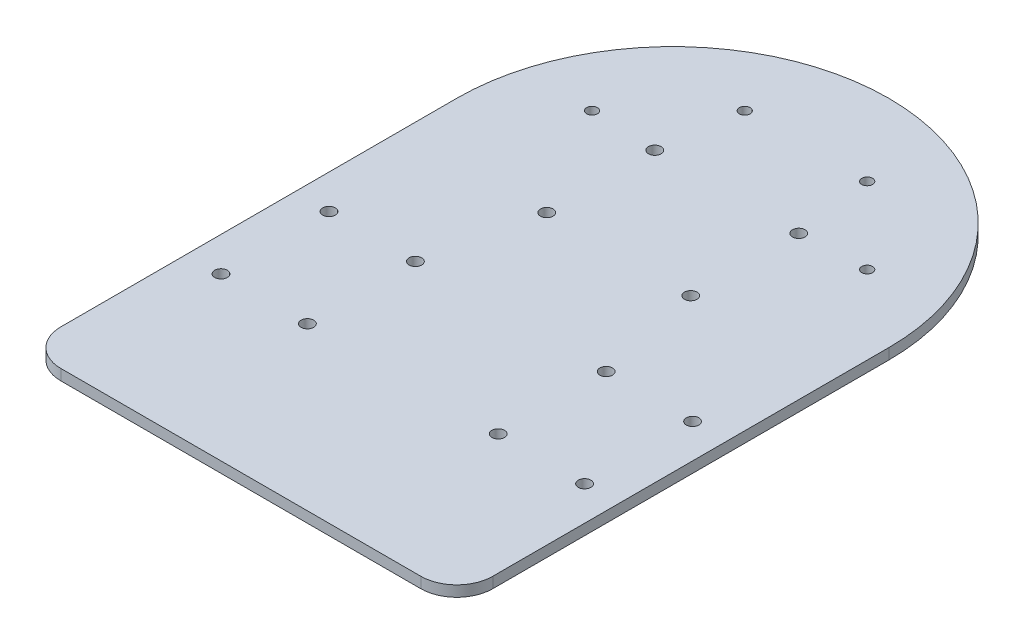
ISO-10303-21;
HEADER;
FILE_DESCRIPTION(('STEP AP214'),'2;1');
FILE_NAME('part.step','',(''),(''),'','','');
FILE_SCHEMA(('AUTOMOTIVE_DESIGN { 1 0 10303 214 1 1 1 1 }'));
ENDSEC;
DATA;
#1=APPLICATION_CONTEXT('core data for automotive mechanical design processes');
#2=APPLICATION_PROTOCOL_DEFINITION('international standard','automotive_design',2000,#1);
#3=PRODUCT_CONTEXT('',#1,'mechanical');
#4=PRODUCT('Part','Part','',(#3));
#5=PRODUCT_RELATED_PRODUCT_CATEGORY('part','',(#4));
#6=PRODUCT_DEFINITION_FORMATION('','',#4);
#7=PRODUCT_DEFINITION_CONTEXT('part definition',#1,'design');
#8=PRODUCT_DEFINITION('design','',#6,#7);
#9=PRODUCT_DEFINITION_SHAPE('','',#8);
#10=(LENGTH_UNIT() NAMED_UNIT(*) SI_UNIT(.MILLI.,.METRE.));
#11=(NAMED_UNIT(*) PLANE_ANGLE_UNIT() SI_UNIT($,.RADIAN.));
#12=(NAMED_UNIT(*) SI_UNIT($,.STERADIAN.) SOLID_ANGLE_UNIT());
#13=UNCERTAINTY_MEASURE_WITH_UNIT(LENGTH_MEASURE(1.E-05),#10,'distance_accuracy_value','');
#14=(GEOMETRIC_REPRESENTATION_CONTEXT(3) GLOBAL_UNCERTAINTY_ASSIGNED_CONTEXT((#13)) GLOBAL_UNIT_ASSIGNED_CONTEXT((#10,
#11,#12)) REPRESENTATION_CONTEXT('',''));
#15=CARTESIAN_POINT('',(0.,0.,0.));
#16=DIRECTION('',(0.,0.,1.));
#17=DIRECTION('',(1.,0.,0.));
#18=AXIS2_PLACEMENT_3D('',#15,#16,#17);
#19=CARTESIAN_POINT('',(0.,3.,-60.));
#20=DIRECTION('',(0.,-1.,0.));
#21=DIRECTION('',(0.,0.,-1.));
#22=AXIS2_PLACEMENT_3D('',#19,#20,#21);
#23=CYLINDRICAL_SURFACE('',#22,60.);
#24=CARTESIAN_POINT('',(0.,0.,-60.));
#25=DIRECTION('',(0.,1.,0.));
#26=DIRECTION('',(0.,0.,1.));
#27=AXIS2_PLACEMENT_3D('',#24,#25,#26);
#28=CIRCLE('',#27,60.);
#29=CARTESIAN_POINT('',(60.,0.,-60.));
#30=VERTEX_POINT('',#29);
#31=CARTESIAN_POINT('',(-60.,0.,-60.));
#32=VERTEX_POINT('',#31);
#33=EDGE_CURVE('E116',#30,#32,#28,.T.);
#34=ORIENTED_EDGE('',*,*,#33,.T.);
#35=DIRECTION('',(0.,-1.,0.));
#36=VECTOR('',#35,1.);
#37=CARTESIAN_POINT('',(-60.,3.,-60.));
#38=LINE('',#37,#36);
#39=CARTESIAN_POINT('',(-60.,3.,-60.));
#40=VERTEX_POINT('',#39);
#41=EDGE_CURVE('E97',#40,#32,#38,.T.);
#42=ORIENTED_EDGE('',*,*,#41,.F.);
#43=CARTESIAN_POINT('',(0.,3.,-60.));
#44=DIRECTION('',(0.,1.,0.));
#45=DIRECTION('',(0.,0.,1.));
#46=AXIS2_PLACEMENT_3D('',#43,#44,#45);
#47=CIRCLE('',#46,60.);
#48=CARTESIAN_POINT('',(60.,3.,-60.));
#49=VERTEX_POINT('',#48);
#50=EDGE_CURVE('E103',#49,#40,#47,.T.);
#51=ORIENTED_EDGE('',*,*,#50,.F.);
#52=DIRECTION('',(0.,-1.,0.));
#53=VECTOR('',#52,1.);
#54=CARTESIAN_POINT('',(60.,3.,-60.));
#55=LINE('',#54,#53);
#56=EDGE_CURVE('E119',#49,#30,#55,.T.);
#57=ORIENTED_EDGE('',*,*,#56,.T.);
#58=EDGE_LOOP('',(#34,#42,#51,#57));
#59=FACE_BOUND('',#58,.T.);
#60=ADVANCED_FACE('F40',(#59),#23,.T.);
#61=CARTESIAN_POINT('',(-60.,3.,-60.));
#62=DIRECTION('',(1.,0.,0.));
#63=DIRECTION('',(0.,0.,-1.));
#64=AXIS2_PLACEMENT_3D('',#61,#62,#63);
#65=PLANE('',#64);
#66=DIRECTION('',(0.,0.,1.));
#67=VECTOR('',#66,1.);
#68=CARTESIAN_POINT('',(-60.,0.,-60.));
#69=LINE('',#68,#67);
#70=CARTESIAN_POINT('',(-60.,0.,50.));
#71=VERTEX_POINT('',#70);
#72=EDGE_CURVE('E159',#32,#71,#69,.T.);
#73=ORIENTED_EDGE('',*,*,#72,.T.);
#74=DIRECTION('',(0.,-1.,0.));
#75=VECTOR('',#74,1.);
#76=CARTESIAN_POINT('',(-60.,3.,50.));
#77=LINE('',#76,#75);
#78=CARTESIAN_POINT('',(-60.,3.,50.));
#79=VERTEX_POINT('',#78);
#80=EDGE_CURVE('E11',#71,#79,#77,.F.);
#81=ORIENTED_EDGE('',*,*,#80,.T.);
#82=DIRECTION('',(0.,0.,1.));
#83=VECTOR('',#82,1.);
#84=CARTESIAN_POINT('',(-60.,3.,-60.));
#85=LINE('',#84,#83);
#86=EDGE_CURVE('E93',#40,#79,#85,.T.);
#87=ORIENTED_EDGE('',*,*,#86,.F.);
#88=ORIENTED_EDGE('',*,*,#41,.T.);
#89=EDGE_LOOP('',(#73,#81,#87,#88));
#90=FACE_BOUND('',#89,.T.);
#91=ADVANCED_FACE('F95',(#90),#65,.F.);
#92=CARTESIAN_POINT('',(-60.,3.,60.));
#93=DIRECTION('',(0.,0.,-1.));
#94=DIRECTION('',(-1.,0.,0.));
#95=AXIS2_PLACEMENT_3D('',#92,#93,#94);
#96=PLANE('',#95);
#97=DIRECTION('',(1.,0.,0.));
#98=VECTOR('',#97,1.);
#99=CARTESIAN_POINT('',(-60.,0.,60.));
#100=LINE('',#99,#98);
#101=CARTESIAN_POINT('',(-50.,0.,60.));
#102=VERTEX_POINT('',#101);
#103=CARTESIAN_POINT('',(50.,0.,60.));
#104=VERTEX_POINT('',#103);
#105=EDGE_CURVE('E155',#102,#104,#100,.T.);
#106=ORIENTED_EDGE('',*,*,#105,.T.);
#107=DIRECTION('',(0.,-1.,0.));
#108=VECTOR('',#107,1.);
#109=CARTESIAN_POINT('',(50.,3.,60.));
#110=LINE('',#109,#108);
#111=CARTESIAN_POINT('',(50.,3.,60.));
#112=VERTEX_POINT('',#111);
#113=EDGE_CURVE('E62',#104,#112,#110,.F.);
#114=ORIENTED_EDGE('',*,*,#113,.T.);
#115=DIRECTION('',(1.,0.,0.));
#116=VECTOR('',#115,1.);
#117=CARTESIAN_POINT('',(-60.,3.,60.));
#118=LINE('',#117,#116);
#119=CARTESIAN_POINT('',(-50.,3.,60.));
#120=VERTEX_POINT('',#119);
#121=EDGE_CURVE('E102',#120,#112,#118,.T.);
#122=ORIENTED_EDGE('',*,*,#121,.F.);
#123=DIRECTION('',(0.,-1.,0.));
#124=VECTOR('',#123,1.);
#125=CARTESIAN_POINT('',(-50.,3.,60.));
#126=LINE('',#125,#124);
#127=EDGE_CURVE('E134',#120,#102,#126,.T.);
#128=ORIENTED_EDGE('',*,*,#127,.T.);
#129=EDGE_LOOP('',(#106,#114,#122,#128));
#130=FACE_BOUND('',#129,.T.);
#131=ADVANCED_FACE('F156',(#130),#96,.F.);
#132=CARTESIAN_POINT('',(60.,3.,-60.));
#133=DIRECTION('',(-1.,0.,0.));
#134=DIRECTION('',(0.,0.,1.));
#135=AXIS2_PLACEMENT_3D('',#132,#133,#134);
#136=PLANE('',#135);
#137=DIRECTION('',(0.,0.,-1.));
#138=VECTOR('',#137,1.);
#139=CARTESIAN_POINT('',(60.,3.,-60.));
#140=LINE('',#139,#138);
#141=CARTESIAN_POINT('',(60.,3.,50.));
#142=VERTEX_POINT('',#141);
#143=EDGE_CURVE('E108',#142,#49,#140,.T.);
#144=ORIENTED_EDGE('',*,*,#143,.F.);
#145=DIRECTION('',(0.,-1.,0.));
#146=VECTOR('',#145,1.);
#147=CARTESIAN_POINT('',(60.,3.,50.));
#148=LINE('',#147,#146);
#149=CARTESIAN_POINT('',(60.,0.,50.));
#150=VERTEX_POINT('',#149);
#151=EDGE_CURVE('E118',#142,#150,#148,.T.);
#152=ORIENTED_EDGE('',*,*,#151,.T.);
#153=DIRECTION('',(0.,0.,-1.));
#154=VECTOR('',#153,1.);
#155=CARTESIAN_POINT('',(60.,0.,-60.));
#156=LINE('',#155,#154);
#157=EDGE_CURVE('E113',#150,#30,#156,.T.);
#158=ORIENTED_EDGE('',*,*,#157,.T.);
#159=ORIENTED_EDGE('',*,*,#56,.F.);
#160=EDGE_LOOP('',(#144,#152,#158,#159));
#161=FACE_BOUND('',#160,.T.);
#162=ADVANCED_FACE('F147',(#161),#136,.F.);
#163=CARTESIAN_POINT('',(0.,3.,-60.));
#164=DIRECTION('',(0.,1.,0.));
#165=DIRECTION('',(0.,0.,1.));
#166=AXIS2_PLACEMENT_3D('',#163,#164,#165);
#167=PLANE('',#166);
#168=CARTESIAN_POINT('',(38.2132034355964,3.,-75.7867965644035));
#169=DIRECTION('',(0.,1.,0.));
#170=DIRECTION('',(0.,0.,-1.));
#171=AXIS2_PLACEMENT_3D('',#168,#169,#170);
#172=CIRCLE('',#171,1.50000000000002);
#173=CARTESIAN_POINT('',(38.2132034355964,3.,-77.2867965644036));
#174=VERTEX_POINT('',#173);
#175=EDGE_CURVE('E279',#174,#174,#172,.T.);
#176=ORIENTED_EDGE('',*,*,#175,.F.);
#177=EDGE_LOOP('',(#176));
#178=FACE_BOUND('',#177,.T.);
#179=CARTESIAN_POINT('',(-17.,3.,-97.));
#180=DIRECTION('',(0.,1.,0.));
#181=DIRECTION('',(0.,0.,1.));
#182=AXIS2_PLACEMENT_3D('',#179,#180,#181);
#183=CIRCLE('',#182,1.5);
#184=CARTESIAN_POINT('',(-17.,3.,-95.5));
#185=VERTEX_POINT('',#184);
#186=EDGE_CURVE('E278',#185,#185,#183,.T.);
#187=ORIENTED_EDGE('',*,*,#186,.F.);
#188=EDGE_LOOP('',(#187));
#189=FACE_BOUND('',#188,.T.);
#190=CARTESIAN_POINT('',(-38.2132034355964,3.,-75.7867965644035));
#191=DIRECTION('',(0.,1.,0.));
#192=DIRECTION('',(0.,0.,1.));
#193=AXIS2_PLACEMENT_3D('',#190,#191,#192);
#194=CIRCLE('',#193,1.50000000000002);
#195=CARTESIAN_POINT('',(-38.2132034355964,3.,-74.2867965644035));
#196=VERTEX_POINT('',#195);
#197=EDGE_CURVE('E287',#196,#196,#194,.T.);
#198=ORIENTED_EDGE('',*,*,#197,.F.);
#199=EDGE_LOOP('',(#198));
#200=FACE_BOUND('',#199,.T.);
#201=CARTESIAN_POINT('',(17.,3.,-97.));
#202=DIRECTION('',(0.,1.,0.));
#203=DIRECTION('',(0.,0.,-1.));
#204=AXIS2_PLACEMENT_3D('',#201,#202,#203);
#205=CIRCLE('',#204,1.5);
#206=CARTESIAN_POINT('',(17.,3.,-98.5));
#207=VERTEX_POINT('',#206);
#208=EDGE_CURVE('E269',#207,#207,#205,.T.);
#209=ORIENTED_EDGE('',*,*,#208,.F.);
#210=EDGE_LOOP('',(#209));
#211=FACE_BOUND('',#210,.T.);
#212=CARTESIAN_POINT('',(20.0000000000003,3.,-45.));
#213=DIRECTION('',(0.,1.,0.));
#214=DIRECTION('',(0.,0.,1.));
#215=AXIS2_PLACEMENT_3D('',#212,#213,#214);
#216=CIRCLE('',#215,1.75);
#217=CARTESIAN_POINT('',(20.0000000000003,3.,-43.25));
#218=VERTEX_POINT('',#217);
#219=EDGE_CURVE('E247',#218,#218,#216,.T.);
#220=ORIENTED_EDGE('',*,*,#219,.F.);
#221=EDGE_LOOP('',(#220));
#222=FACE_BOUND('',#221,.T.);
#223=CARTESIAN_POINT('',(-19.9999999999997,3.,-44.9999999999997));
#224=DIRECTION('',(0.,1.,0.));
#225=DIRECTION('',(0.,0.,1.));
#226=AXIS2_PLACEMENT_3D('',#223,#224,#225);
#227=CIRCLE('',#226,1.75);
#228=CARTESIAN_POINT('',(-19.9999999999997,3.,-43.2499999999997));
#229=VERTEX_POINT('',#228);
#230=EDGE_CURVE('E246',#229,#229,#227,.T.);
#231=ORIENTED_EDGE('',*,*,#230,.F.);
#232=EDGE_LOOP('',(#231));
#233=FACE_BOUND('',#232,.T.);
#234=CARTESIAN_POINT('',(-20.,3.,-74.9999999999997));
#235=DIRECTION('',(0.,1.,0.));
#236=DIRECTION('',(0.,0.,1.));
#237=AXIS2_PLACEMENT_3D('',#234,#235,#236);
#238=CIRCLE('',#237,1.75);
#239=CARTESIAN_POINT('',(-20.,3.,-73.2499999999997));
#240=VERTEX_POINT('',#239);
#241=EDGE_CURVE('E256',#240,#240,#238,.T.);
#242=ORIENTED_EDGE('',*,*,#241,.F.);
#243=EDGE_LOOP('',(#242));
#244=FACE_BOUND('',#243,.T.);
#245=CARTESIAN_POINT('',(20.,3.,-75.));
#246=DIRECTION('',(0.,1.,0.));
#247=DIRECTION('',(0.,0.,1.));
#248=AXIS2_PLACEMENT_3D('',#245,#246,#247);
#249=CIRCLE('',#248,1.75);
#250=CARTESIAN_POINT('',(20.,3.,-73.25));
#251=VERTEX_POINT('',#250);
#252=EDGE_CURVE('E237',#251,#251,#249,.T.);
#253=ORIENTED_EDGE('',*,*,#252,.F.);
#254=EDGE_LOOP('',(#253));
#255=FACE_BOUND('',#254,.T.);
#256=CARTESIAN_POINT('',(26.5000000000001,3.,-15.));
#257=DIRECTION('',(0.,-1.,0.));
#258=DIRECTION('',(0.,0.,1.));
#259=AXIS2_PLACEMENT_3D('',#256,#257,#258);
#260=CIRCLE('',#259,1.75);
#261=CARTESIAN_POINT('',(26.5000000000001,3.,-13.25));
#262=VERTEX_POINT('',#261);
#263=EDGE_CURVE('E214',#262,#262,#260,.T.);
#264=ORIENTED_EDGE('',*,*,#263,.T.);
#265=EDGE_LOOP('',(#264));
#266=FACE_BOUND('',#265,.T.);
#267=CARTESIAN_POINT('',(50.5000000000001,3.,-14.9999999999998));
#268=DIRECTION('',(0.,-1.,0.));
#269=DIRECTION('',(0.,0.,1.));
#270=AXIS2_PLACEMENT_3D('',#267,#268,#269);
#271=CIRCLE('',#270,1.75);
#272=CARTESIAN_POINT('',(50.5000000000001,3.,-13.2499999999998));
#273=VERTEX_POINT('',#272);
#274=EDGE_CURVE('E223',#273,#273,#271,.T.);
#275=ORIENTED_EDGE('',*,*,#274,.T.);
#276=EDGE_LOOP('',(#275));
#277=FACE_BOUND('',#276,.T.);
#278=CARTESIAN_POINT('',(50.5,3.,15.0000000000002));
#279=DIRECTION('',(0.,-1.,0.));
#280=DIRECTION('',(0.,0.,1.));
#281=AXIS2_PLACEMENT_3D('',#278,#279,#280);
#282=CIRCLE('',#281,1.75);
#283=CARTESIAN_POINT('',(50.5,3.,16.7500000000002));
#284=VERTEX_POINT('',#283);
#285=EDGE_CURVE('E206',#284,#284,#282,.T.);
#286=ORIENTED_EDGE('',*,*,#285,.T.);
#287=EDGE_LOOP('',(#286));
#288=FACE_BOUND('',#287,.T.);
#289=CARTESIAN_POINT('',(26.5,3.,15.));
#290=DIRECTION('',(0.,-1.,0.));
#291=DIRECTION('',(0.,0.,1.));
#292=AXIS2_PLACEMENT_3D('',#289,#290,#291);
#293=CIRCLE('',#292,1.75);
#294=CARTESIAN_POINT('',(26.5,3.,16.75));
#295=VERTEX_POINT('',#294);
#296=EDGE_CURVE('E187',#295,#295,#293,.T.);
#297=ORIENTED_EDGE('',*,*,#296,.T.);
#298=EDGE_LOOP('',(#297));
#299=FACE_BOUND('',#298,.T.);
#300=CARTESIAN_POINT('',(-26.5000000000001,3.,-15.));
#301=DIRECTION('',(0.,1.,0.));
#302=DIRECTION('',(0.,0.,1.));
#303=AXIS2_PLACEMENT_3D('',#300,#301,#302);
#304=CIRCLE('',#303,1.75);
#305=CARTESIAN_POINT('',(-26.5000000000001,3.,-13.25));
#306=VERTEX_POINT('',#305);
#307=EDGE_CURVE('E183',#306,#306,#304,.T.);
#308=ORIENTED_EDGE('',*,*,#307,.F.);
#309=EDGE_LOOP('',(#308));
#310=FACE_BOUND('',#309,.T.);
#311=CARTESIAN_POINT('',(-50.5000000000001,3.,-14.9999999999998));
#312=DIRECTION('',(0.,1.,0.));
#313=DIRECTION('',(0.,0.,1.));
#314=AXIS2_PLACEMENT_3D('',#311,#312,#313);
#315=CIRCLE('',#314,1.75);
#316=CARTESIAN_POINT('',(-50.5000000000001,3.,-13.2499999999998));
#317=VERTEX_POINT('',#316);
#318=EDGE_CURVE('E182',#317,#317,#315,.T.);
#319=ORIENTED_EDGE('',*,*,#318,.F.);
#320=EDGE_LOOP('',(#319));
#321=FACE_BOUND('',#320,.T.);
#322=CARTESIAN_POINT('',(-50.5,3.,15.0000000000002));
#323=DIRECTION('',(0.,1.,0.));
#324=DIRECTION('',(0.,0.,1.));
#325=AXIS2_PLACEMENT_3D('',#322,#323,#324);
#326=CIRCLE('',#325,1.75);
#327=CARTESIAN_POINT('',(-50.5,3.,16.7500000000002));
#328=VERTEX_POINT('',#327);
#329=EDGE_CURVE('E192',#328,#328,#326,.T.);
#330=ORIENTED_EDGE('',*,*,#329,.F.);
#331=EDGE_LOOP('',(#330));
#332=FACE_BOUND('',#331,.T.);
#333=CARTESIAN_POINT('',(-26.5,3.,15.));
#334=DIRECTION('',(0.,1.,0.));
#335=DIRECTION('',(0.,0.,1.));
#336=AXIS2_PLACEMENT_3D('',#333,#334,#335);
#337=CIRCLE('',#336,1.75);
#338=CARTESIAN_POINT('',(-26.5,3.,16.75));
#339=VERTEX_POINT('',#338);
#340=EDGE_CURVE('E173',#339,#339,#337,.T.);
#341=ORIENTED_EDGE('',*,*,#340,.F.);
#342=EDGE_LOOP('',(#341));
#343=FACE_BOUND('',#342,.T.);
#344=ORIENTED_EDGE('',*,*,#121,.T.);
#345=CARTESIAN_POINT('',(50.,3.,50.));
#346=DIRECTION('',(0.,1.,0.));
#347=DIRECTION('',(0.,0.,1.));
#348=AXIS2_PLACEMENT_3D('',#345,#346,#347);
#349=CIRCLE('',#348,10.);
#350=EDGE_CURVE('E49',#112,#142,#349,.T.);
#351=ORIENTED_EDGE('',*,*,#350,.T.);
#352=ORIENTED_EDGE('',*,*,#143,.T.);
#353=ORIENTED_EDGE('',*,*,#50,.T.);
#354=ORIENTED_EDGE('',*,*,#86,.T.);
#355=CARTESIAN_POINT('',(-50.,3.,50.));
#356=DIRECTION('',(0.,1.,0.));
#357=DIRECTION('',(0.,0.,1.));
#358=AXIS2_PLACEMENT_3D('',#355,#356,#357);
#359=CIRCLE('',#358,10.);
#360=EDGE_CURVE('E140',#79,#120,#359,.T.);
#361=ORIENTED_EDGE('',*,*,#360,.T.);
#362=EDGE_LOOP('',(#344,#351,#352,#353,#354,#361));
#363=FACE_BOUND('',#362,.T.);
#364=ADVANCED_FACE('F106',(#178,#189,#200,#211,#222,#233,#244,#255,#266,#277,#288,#299,#310,
#321,#332,#343,#363),#167,.T.);
#365=CARTESIAN_POINT('',(0.,0.,-60.));
#366=DIRECTION('',(0.,1.,0.));
#367=DIRECTION('',(0.,0.,1.));
#368=AXIS2_PLACEMENT_3D('',#365,#366,#367);
#369=PLANE('',#368);
#370=CARTESIAN_POINT('',(38.2132034355964,0.,-75.7867965644035));
#371=DIRECTION('',(0.,1.,0.));
#372=DIRECTION('',(0.,0.,1.));
#373=AXIS2_PLACEMENT_3D('',#370,#371,#372);
#374=CIRCLE('',#373,1.50000000000002);
#375=CARTESIAN_POINT('',(38.2132034355964,0.,-74.2867965644035));
#376=VERTEX_POINT('',#375);
#377=EDGE_CURVE('E274',#376,#376,#374,.F.);
#378=ORIENTED_EDGE('',*,*,#377,.F.);
#379=EDGE_LOOP('',(#378));
#380=FACE_BOUND('',#379,.T.);
#381=CARTESIAN_POINT('',(-17.,0.,-97.));
#382=DIRECTION('',(0.,1.,0.));
#383=DIRECTION('',(0.,0.,1.));
#384=AXIS2_PLACEMENT_3D('',#381,#382,#383);
#385=CIRCLE('',#384,1.5);
#386=CARTESIAN_POINT('',(-17.,0.,-95.5));
#387=VERTEX_POINT('',#386);
#388=EDGE_CURVE('E283',#387,#387,#385,.F.);
#389=ORIENTED_EDGE('',*,*,#388,.F.);
#390=EDGE_LOOP('',(#389));
#391=FACE_BOUND('',#390,.T.);
#392=CARTESIAN_POINT('',(-38.2132034355964,0.,-75.7867965644035));
#393=DIRECTION('',(0.,1.,0.));
#394=DIRECTION('',(0.,0.,1.));
#395=AXIS2_PLACEMENT_3D('',#392,#393,#394);
#396=CIRCLE('',#395,1.50000000000002);
#397=CARTESIAN_POINT('',(-38.2132034355964,0.,-74.2867965644035));
#398=VERTEX_POINT('',#397);
#399=EDGE_CURVE('E273',#398,#398,#396,.F.);
#400=ORIENTED_EDGE('',*,*,#399,.F.);
#401=EDGE_LOOP('',(#400));
#402=FACE_BOUND('',#401,.T.);
#403=CARTESIAN_POINT('',(17.,0.,-97.));
#404=DIRECTION('',(0.,1.,0.));
#405=DIRECTION('',(0.,0.,1.));
#406=AXIS2_PLACEMENT_3D('',#403,#404,#405);
#407=CIRCLE('',#406,1.5);
#408=CARTESIAN_POINT('',(17.,0.,-95.5));
#409=VERTEX_POINT('',#408);
#410=EDGE_CURVE('E251',#409,#409,#407,.F.);
#411=ORIENTED_EDGE('',*,*,#410,.F.);
#412=EDGE_LOOP('',(#411));
#413=FACE_BOUND('',#412,.T.);
#414=CARTESIAN_POINT('',(20.0000000000003,0.,-45.));
#415=DIRECTION('',(0.,1.,0.));
#416=DIRECTION('',(0.,0.,1.));
#417=AXIS2_PLACEMENT_3D('',#414,#415,#416);
#418=CIRCLE('',#417,1.75);
#419=CARTESIAN_POINT('',(20.0000000000003,0.,-43.25));
#420=VERTEX_POINT('',#419);
#421=EDGE_CURVE('E242',#420,#420,#418,.F.);
#422=ORIENTED_EDGE('',*,*,#421,.F.);
#423=EDGE_LOOP('',(#422));
#424=FACE_BOUND('',#423,.T.);
#425=CARTESIAN_POINT('',(-19.9999999999997,0.,-44.9999999999997));
#426=DIRECTION('',(0.,1.,0.));
#427=DIRECTION('',(0.,0.,1.));
#428=AXIS2_PLACEMENT_3D('',#425,#426,#427);
#429=CIRCLE('',#428,1.75);
#430=CARTESIAN_POINT('',(-19.9999999999997,0.,-43.2499999999997));
#431=VERTEX_POINT('',#430);
#432=EDGE_CURVE('E252',#431,#431,#429,.F.);
#433=ORIENTED_EDGE('',*,*,#432,.F.);
#434=EDGE_LOOP('',(#433));
#435=FACE_BOUND('',#434,.T.);
#436=CARTESIAN_POINT('',(-20.,0.,-74.9999999999997));
#437=DIRECTION('',(0.,1.,0.));
#438=DIRECTION('',(0.,0.,1.));
#439=AXIS2_PLACEMENT_3D('',#436,#437,#438);
#440=CIRCLE('',#439,1.75);
#441=CARTESIAN_POINT('',(-20.,0.,-73.2499999999997));
#442=VERTEX_POINT('',#441);
#443=EDGE_CURVE('E241',#442,#442,#440,.F.);
#444=ORIENTED_EDGE('',*,*,#443,.F.);
#445=EDGE_LOOP('',(#444));
#446=FACE_BOUND('',#445,.T.);
#447=CARTESIAN_POINT('',(20.,0.,-75.));
#448=DIRECTION('',(0.,1.,0.));
#449=DIRECTION('',(0.,0.,1.));
#450=AXIS2_PLACEMENT_3D('',#447,#448,#449);
#451=CIRCLE('',#450,1.75);
#452=CARTESIAN_POINT('',(20.,0.,-73.25));
#453=VERTEX_POINT('',#452);
#454=EDGE_CURVE('E215',#453,#453,#451,.F.);
#455=ORIENTED_EDGE('',*,*,#454,.F.);
#456=EDGE_LOOP('',(#455));
#457=FACE_BOUND('',#456,.T.);
#458=CARTESIAN_POINT('',(26.5000000000001,0.,-15.));
#459=DIRECTION('',(0.,1.,0.));
#460=DIRECTION('',(0.,0.,1.));
#461=AXIS2_PLACEMENT_3D('',#458,#459,#460);
#462=CIRCLE('',#461,1.75);
#463=CARTESIAN_POINT('',(26.5000000000001,0.,-13.25));
#464=VERTEX_POINT('',#463);
#465=EDGE_CURVE('E210',#464,#464,#462,.T.);
#466=ORIENTED_EDGE('',*,*,#465,.T.);
#467=EDGE_LOOP('',(#466));
#468=FACE_BOUND('',#467,.T.);
#469=CARTESIAN_POINT('',(50.5000000000001,0.,-14.9999999999998));
#470=DIRECTION('',(0.,1.,0.));
#471=DIRECTION('',(0.,0.,1.));
#472=AXIS2_PLACEMENT_3D('',#469,#470,#471);
#473=CIRCLE('',#472,1.75);
#474=CARTESIAN_POINT('',(50.5000000000001,0.,-13.2499999999998));
#475=VERTEX_POINT('',#474);
#476=EDGE_CURVE('E219',#475,#475,#473,.T.);
#477=ORIENTED_EDGE('',*,*,#476,.T.);
#478=EDGE_LOOP('',(#477));
#479=FACE_BOUND('',#478,.T.);
#480=CARTESIAN_POINT('',(50.5,0.,15.0000000000002));
#481=DIRECTION('',(0.,1.,0.));
#482=DIRECTION('',(0.,0.,1.));
#483=AXIS2_PLACEMENT_3D('',#480,#481,#482);
#484=CIRCLE('',#483,1.75);
#485=CARTESIAN_POINT('',(50.5,0.,16.7500000000002));
#486=VERTEX_POINT('',#485);
#487=EDGE_CURVE('E227',#486,#486,#484,.T.);
#488=ORIENTED_EDGE('',*,*,#487,.T.);
#489=EDGE_LOOP('',(#488));
#490=FACE_BOUND('',#489,.T.);
#491=CARTESIAN_POINT('',(26.5,0.,15.));
#492=DIRECTION('',(0.,1.,0.));
#493=DIRECTION('',(0.,0.,1.));
#494=AXIS2_PLACEMENT_3D('',#491,#492,#493);
#495=CIRCLE('',#494,1.75);
#496=CARTESIAN_POINT('',(26.5,0.,16.75));
#497=VERTEX_POINT('',#496);
#498=EDGE_CURVE('E202',#497,#497,#495,.T.);
#499=ORIENTED_EDGE('',*,*,#498,.T.);
#500=EDGE_LOOP('',(#499));
#501=FACE_BOUND('',#500,.T.);
#502=CARTESIAN_POINT('',(-26.5000000000001,0.,-15.));
#503=DIRECTION('',(0.,1.,0.));
#504=DIRECTION('',(0.,0.,1.));
#505=AXIS2_PLACEMENT_3D('',#502,#503,#504);
#506=CIRCLE('',#505,1.75);
#507=CARTESIAN_POINT('',(-26.5000000000001,0.,-13.25));
#508=VERTEX_POINT('',#507);
#509=EDGE_CURVE('E178',#508,#508,#506,.F.);
#510=ORIENTED_EDGE('',*,*,#509,.F.);
#511=EDGE_LOOP('',(#510));
#512=FACE_BOUND('',#511,.T.);
#513=CARTESIAN_POINT('',(-50.5000000000001,0.,-14.9999999999998));
#514=DIRECTION('',(0.,1.,0.));
#515=DIRECTION('',(0.,0.,1.));
#516=AXIS2_PLACEMENT_3D('',#513,#514,#515);
#517=CIRCLE('',#516,1.75);
#518=CARTESIAN_POINT('',(-50.5000000000001,0.,-13.2499999999998));
#519=VERTEX_POINT('',#518);
#520=EDGE_CURVE('E188',#519,#519,#517,.F.);
#521=ORIENTED_EDGE('',*,*,#520,.F.);
#522=EDGE_LOOP('',(#521));
#523=FACE_BOUND('',#522,.T.);
#524=CARTESIAN_POINT('',(-50.5,0.,15.0000000000002));
#525=DIRECTION('',(0.,1.,0.));
#526=DIRECTION('',(0.,0.,1.));
#527=AXIS2_PLACEMENT_3D('',#524,#525,#526);
#528=CIRCLE('',#527,1.75);
#529=CARTESIAN_POINT('',(-50.5,0.,16.7500000000002));
#530=VERTEX_POINT('',#529);
#531=EDGE_CURVE('E177',#530,#530,#528,.F.);
#532=ORIENTED_EDGE('',*,*,#531,.F.);
#533=EDGE_LOOP('',(#532));
#534=FACE_BOUND('',#533,.T.);
#535=CARTESIAN_POINT('',(-26.5,0.,15.));
#536=DIRECTION('',(0.,1.,0.));
#537=DIRECTION('',(0.,0.,1.));
#538=AXIS2_PLACEMENT_3D('',#535,#536,#537);
#539=CIRCLE('',#538,1.75);
#540=CARTESIAN_POINT('',(-26.5,0.,16.75));
#541=VERTEX_POINT('',#540);
#542=EDGE_CURVE('E166',#541,#541,#539,.F.);
#543=ORIENTED_EDGE('',*,*,#542,.F.);
#544=EDGE_LOOP('',(#543));
#545=FACE_BOUND('',#544,.T.);
#546=ORIENTED_EDGE('',*,*,#157,.F.);
#547=CARTESIAN_POINT('',(50.,0.,50.));
#548=DIRECTION('',(0.,1.,0.));
#549=DIRECTION('',(0.,0.,1.));
#550=AXIS2_PLACEMENT_3D('',#547,#548,#549);
#551=CIRCLE('',#550,10.);
#552=EDGE_CURVE('E131',#150,#104,#551,.F.);
#553=ORIENTED_EDGE('',*,*,#552,.T.);
#554=ORIENTED_EDGE('',*,*,#105,.F.);
#555=CARTESIAN_POINT('',(-50.,0.,50.));
#556=DIRECTION('',(0.,1.,0.));
#557=DIRECTION('',(0.,0.,1.));
#558=AXIS2_PLACEMENT_3D('',#555,#556,#557);
#559=CIRCLE('',#558,10.);
#560=EDGE_CURVE('E124',#102,#71,#559,.F.);
#561=ORIENTED_EDGE('',*,*,#560,.T.);
#562=ORIENTED_EDGE('',*,*,#72,.F.);
#563=ORIENTED_EDGE('',*,*,#33,.F.);
#564=EDGE_LOOP('',(#546,#553,#554,#561,#562,#563));
#565=FACE_BOUND('',#564,.T.);
#566=ADVANCED_FACE('F154',(#380,#391,#402,#413,#424,#435,#446,#457,#468,#479,#490,#501,#512,
#523,#534,#545,#565),#369,.F.);
#567=CARTESIAN_POINT('',(50.,3.,50.));
#568=DIRECTION('',(0.,-1.,0.));
#569=DIRECTION('',(0.,0.,-1.));
#570=AXIS2_PLACEMENT_3D('',#567,#568,#569);
#571=CYLINDRICAL_SURFACE('',#570,10.);
#572=ORIENTED_EDGE('',*,*,#350,.F.);
#573=ORIENTED_EDGE('',*,*,#113,.F.);
#574=ORIENTED_EDGE('',*,*,#552,.F.);
#575=ORIENTED_EDGE('',*,*,#151,.F.);
#576=EDGE_LOOP('',(#572,#573,#574,#575));
#577=FACE_BOUND('',#576,.T.);
#578=ADVANCED_FACE('F151',(#577),#571,.T.);
#579=CARTESIAN_POINT('',(-50.,3.,50.));
#580=DIRECTION('',(0.,-1.,0.));
#581=DIRECTION('',(0.,0.,-1.));
#582=AXIS2_PLACEMENT_3D('',#579,#580,#581);
#583=CYLINDRICAL_SURFACE('',#582,10.);
#584=ORIENTED_EDGE('',*,*,#360,.F.);
#585=ORIENTED_EDGE('',*,*,#80,.F.);
#586=ORIENTED_EDGE('',*,*,#560,.F.);
#587=ORIENTED_EDGE('',*,*,#127,.F.);
#588=EDGE_LOOP('',(#584,#585,#586,#587));
#589=FACE_BOUND('',#588,.T.);
#590=ADVANCED_FACE('F42',(#589),#583,.T.);
#591=CARTESIAN_POINT('',(-26.5,-0.00100000000000013,15.));
#592=DIRECTION('',(0.,1.,0.));
#593=DIRECTION('',(0.,0.,1.));
#594=AXIS2_PLACEMENT_3D('',#591,#592,#593);
#595=CYLINDRICAL_SURFACE('',#594,1.75);
#596=ORIENTED_EDGE('',*,*,#340,.T.);
#597=EDGE_LOOP('',(#596));
#598=FACE_BOUND('',#597,.T.);
#599=ORIENTED_EDGE('',*,*,#542,.T.);
#600=EDGE_LOOP('',(#599));
#601=FACE_BOUND('',#600,.T.);
#602=ADVANCED_FACE('F331',(#598,#601),#595,.F.);
#603=CARTESIAN_POINT('',(-50.5,-0.00100000000000013,15.0000000000002));
#604=DIRECTION('',(0.,1.,0.));
#605=DIRECTION('',(0.,0.,1.));
#606=AXIS2_PLACEMENT_3D('',#603,#604,#605);
#607=CYLINDRICAL_SURFACE('',#606,1.75);
#608=ORIENTED_EDGE('',*,*,#329,.T.);
#609=EDGE_LOOP('',(#608));
#610=FACE_BOUND('',#609,.T.);
#611=ORIENTED_EDGE('',*,*,#531,.T.);
#612=EDGE_LOOP('',(#611));
#613=FACE_BOUND('',#612,.T.);
#614=ADVANCED_FACE('F334',(#610,#613),#607,.F.);
#615=CARTESIAN_POINT('',(-50.5000000000001,-0.00100000000000013,-14.9999999999998));
#616=DIRECTION('',(0.,1.,0.));
#617=DIRECTION('',(0.,0.,1.));
#618=AXIS2_PLACEMENT_3D('',#615,#616,#617);
#619=CYLINDRICAL_SURFACE('',#618,1.75);
#620=ORIENTED_EDGE('',*,*,#318,.T.);
#621=EDGE_LOOP('',(#620));
#622=FACE_BOUND('',#621,.T.);
#623=ORIENTED_EDGE('',*,*,#520,.T.);
#624=EDGE_LOOP('',(#623));
#625=FACE_BOUND('',#624,.T.);
#626=ADVANCED_FACE('F392',(#622,#625),#619,.F.);
#627=CARTESIAN_POINT('',(-26.5000000000001,-0.00100000000000013,-15.));
#628=DIRECTION('',(0.,1.,0.));
#629=DIRECTION('',(0.,0.,1.));
#630=AXIS2_PLACEMENT_3D('',#627,#628,#629);
#631=CYLINDRICAL_SURFACE('',#630,1.75);
#632=ORIENTED_EDGE('',*,*,#307,.T.);
#633=EDGE_LOOP('',(#632));
#634=FACE_BOUND('',#633,.T.);
#635=ORIENTED_EDGE('',*,*,#509,.T.);
#636=EDGE_LOOP('',(#635));
#637=FACE_BOUND('',#636,.T.);
#638=ADVANCED_FACE('F400',(#634,#637),#631,.F.);
#639=CARTESIAN_POINT('',(26.5,-0.00100000000000013,15.));
#640=DIRECTION('',(0.,1.,0.));
#641=DIRECTION('',(0.,0.,1.));
#642=AXIS2_PLACEMENT_3D('',#639,#640,#641);
#643=CYLINDRICAL_SURFACE('',#642,1.75);
#644=ORIENTED_EDGE('',*,*,#296,.F.);
#645=EDGE_LOOP('',(#644));
#646=FACE_BOUND('',#645,.T.);
#647=ORIENTED_EDGE('',*,*,#498,.F.);
#648=EDGE_LOOP('',(#647));
#649=FACE_BOUND('',#648,.T.);
#650=ADVANCED_FACE('F408',(#646,#649),#643,.F.);
#651=CARTESIAN_POINT('',(50.5,-0.00100000000000013,15.0000000000002));
#652=DIRECTION('',(0.,1.,0.));
#653=DIRECTION('',(0.,0.,1.));
#654=AXIS2_PLACEMENT_3D('',#651,#652,#653);
#655=CYLINDRICAL_SURFACE('',#654,1.75);
#656=ORIENTED_EDGE('',*,*,#285,.F.);
#657=EDGE_LOOP('',(#656));
#658=FACE_BOUND('',#657,.T.);
#659=ORIENTED_EDGE('',*,*,#487,.F.);
#660=EDGE_LOOP('',(#659));
#661=FACE_BOUND('',#660,.T.);
#662=ADVANCED_FACE('F416',(#658,#661),#655,.F.);
#663=CARTESIAN_POINT('',(50.5000000000001,-0.00100000000000013,-14.9999999999998));
#664=DIRECTION('',(0.,1.,0.));
#665=DIRECTION('',(0.,0.,1.));
#666=AXIS2_PLACEMENT_3D('',#663,#664,#665);
#667=CYLINDRICAL_SURFACE('',#666,1.75);
#668=ORIENTED_EDGE('',*,*,#274,.F.);
#669=EDGE_LOOP('',(#668));
#670=FACE_BOUND('',#669,.T.);
#671=ORIENTED_EDGE('',*,*,#476,.F.);
#672=EDGE_LOOP('',(#671));
#673=FACE_BOUND('',#672,.T.);
#674=ADVANCED_FACE('F424',(#670,#673),#667,.F.);
#675=CARTESIAN_POINT('',(26.5000000000001,-0.00100000000000013,-15.));
#676=DIRECTION('',(0.,1.,0.));
#677=DIRECTION('',(0.,0.,1.));
#678=AXIS2_PLACEMENT_3D('',#675,#676,#677);
#679=CYLINDRICAL_SURFACE('',#678,1.75);
#680=ORIENTED_EDGE('',*,*,#263,.F.);
#681=EDGE_LOOP('',(#680));
#682=FACE_BOUND('',#681,.T.);
#683=ORIENTED_EDGE('',*,*,#465,.F.);
#684=EDGE_LOOP('',(#683));
#685=FACE_BOUND('',#684,.T.);
#686=ADVANCED_FACE('F432',(#682,#685),#679,.F.);
#687=CARTESIAN_POINT('',(20.,-0.00100000000000013,-75.));
#688=DIRECTION('',(0.,1.,0.));
#689=DIRECTION('',(0.,0.,1.));
#690=AXIS2_PLACEMENT_3D('',#687,#688,#689);
#691=CYLINDRICAL_SURFACE('',#690,1.75);
#692=ORIENTED_EDGE('',*,*,#252,.T.);
#693=EDGE_LOOP('',(#692));
#694=FACE_BOUND('',#693,.T.);
#695=ORIENTED_EDGE('',*,*,#454,.T.);
#696=EDGE_LOOP('',(#695));
#697=FACE_BOUND('',#696,.T.);
#698=ADVANCED_FACE('F440',(#694,#697),#691,.F.);
#699=CARTESIAN_POINT('',(-20.,-0.00100000000000013,-74.9999999999997));
#700=DIRECTION('',(0.,1.,0.));
#701=DIRECTION('',(0.,0.,1.));
#702=AXIS2_PLACEMENT_3D('',#699,#700,#701);
#703=CYLINDRICAL_SURFACE('',#702,1.75);
#704=ORIENTED_EDGE('',*,*,#241,.T.);
#705=EDGE_LOOP('',(#704));
#706=FACE_BOUND('',#705,.T.);
#707=ORIENTED_EDGE('',*,*,#443,.T.);
#708=EDGE_LOOP('',(#707));
#709=FACE_BOUND('',#708,.T.);
#710=ADVANCED_FACE('F448',(#706,#709),#703,.F.);
#711=CARTESIAN_POINT('',(-19.9999999999997,-0.00100000000000013,-44.9999999999997));
#712=DIRECTION('',(0.,1.,0.));
#713=DIRECTION('',(0.,0.,1.));
#714=AXIS2_PLACEMENT_3D('',#711,#712,#713);
#715=CYLINDRICAL_SURFACE('',#714,1.75);
#716=ORIENTED_EDGE('',*,*,#230,.T.);
#717=EDGE_LOOP('',(#716));
#718=FACE_BOUND('',#717,.T.);
#719=ORIENTED_EDGE('',*,*,#432,.T.);
#720=EDGE_LOOP('',(#719));
#721=FACE_BOUND('',#720,.T.);
#722=ADVANCED_FACE('F456',(#718,#721),#715,.F.);
#723=CARTESIAN_POINT('',(20.0000000000003,-0.00100000000000013,-45.));
#724=DIRECTION('',(0.,1.,0.));
#725=DIRECTION('',(0.,0.,1.));
#726=AXIS2_PLACEMENT_3D('',#723,#724,#725);
#727=CYLINDRICAL_SURFACE('',#726,1.75);
#728=ORIENTED_EDGE('',*,*,#219,.T.);
#729=EDGE_LOOP('',(#728));
#730=FACE_BOUND('',#729,.T.);
#731=ORIENTED_EDGE('',*,*,#421,.T.);
#732=EDGE_LOOP('',(#731));
#733=FACE_BOUND('',#732,.T.);
#734=ADVANCED_FACE('F464',(#730,#733),#727,.F.);
#735=CARTESIAN_POINT('',(17.,-0.00100000000000013,-97.));
#736=DIRECTION('',(0.,1.,0.));
#737=DIRECTION('',(0.,0.,1.));
#738=AXIS2_PLACEMENT_3D('',#735,#736,#737);
#739=CYLINDRICAL_SURFACE('',#738,1.5);
#740=ORIENTED_EDGE('',*,*,#208,.T.);
#741=EDGE_LOOP('',(#740));
#742=FACE_BOUND('',#741,.T.);
#743=ORIENTED_EDGE('',*,*,#410,.T.);
#744=EDGE_LOOP('',(#743));
#745=FACE_BOUND('',#744,.T.);
#746=ADVANCED_FACE('F471',(#742,#745),#739,.F.);
#747=CARTESIAN_POINT('',(-38.2132034355964,-0.00100000000000013,-75.7867965644035));
#748=DIRECTION('',(0.,1.,0.));
#749=DIRECTION('',(0.,0.,1.));
#750=AXIS2_PLACEMENT_3D('',#747,#748,#749);
#751=CYLINDRICAL_SURFACE('',#750,1.50000000000002);
#752=ORIENTED_EDGE('',*,*,#197,.T.);
#753=EDGE_LOOP('',(#752));
#754=FACE_BOUND('',#753,.T.);
#755=ORIENTED_EDGE('',*,*,#399,.T.);
#756=EDGE_LOOP('',(#755));
#757=FACE_BOUND('',#756,.T.);
#758=ADVANCED_FACE('F298',(#754,#757),#751,.F.);
#759=CARTESIAN_POINT('',(-17.,-0.00100000000000013,-97.));
#760=DIRECTION('',(0.,1.,0.));
#761=DIRECTION('',(0.,0.,1.));
#762=AXIS2_PLACEMENT_3D('',#759,#760,#761);
#763=CYLINDRICAL_SURFACE('',#762,1.5);
#764=ORIENTED_EDGE('',*,*,#186,.T.);
#765=EDGE_LOOP('',(#764));
#766=FACE_BOUND('',#765,.T.);
#767=ORIENTED_EDGE('',*,*,#388,.T.);
#768=EDGE_LOOP('',(#767));
#769=FACE_BOUND('',#768,.T.);
#770=ADVANCED_FACE('F485',(#766,#769),#763,.F.);
#771=CARTESIAN_POINT('',(38.2132034355964,-0.00100000000000013,-75.7867965644035));
#772=DIRECTION('',(0.,1.,0.));
#773=DIRECTION('',(0.,0.,1.));
#774=AXIS2_PLACEMENT_3D('',#771,#772,#773);
#775=CYLINDRICAL_SURFACE('',#774,1.50000000000002);
#776=ORIENTED_EDGE('',*,*,#175,.T.);
#777=EDGE_LOOP('',(#776));
#778=FACE_BOUND('',#777,.T.);
#779=ORIENTED_EDGE('',*,*,#377,.T.);
#780=EDGE_LOOP('',(#779));
#781=FACE_BOUND('',#780,.T.);
#782=ADVANCED_FACE('F492',(#778,#781),#775,.F.);
#783=CLOSED_SHELL('',(#60,#91,#131,#162,#364,#566,#578,#590,#602,#614,#626,#638,#650,#662,#674,
#686,#698,#710,#722,#734,#746,#758,#770,#782));
#784=MANIFOLD_SOLID_BREP('B2',#783);
#785=ADVANCED_BREP_SHAPE_REPRESENTATION('',(#18,#784),#14);
#786=SHAPE_DEFINITION_REPRESENTATION(#9,#785);
ENDSEC;
END-ISO-10303-21;
